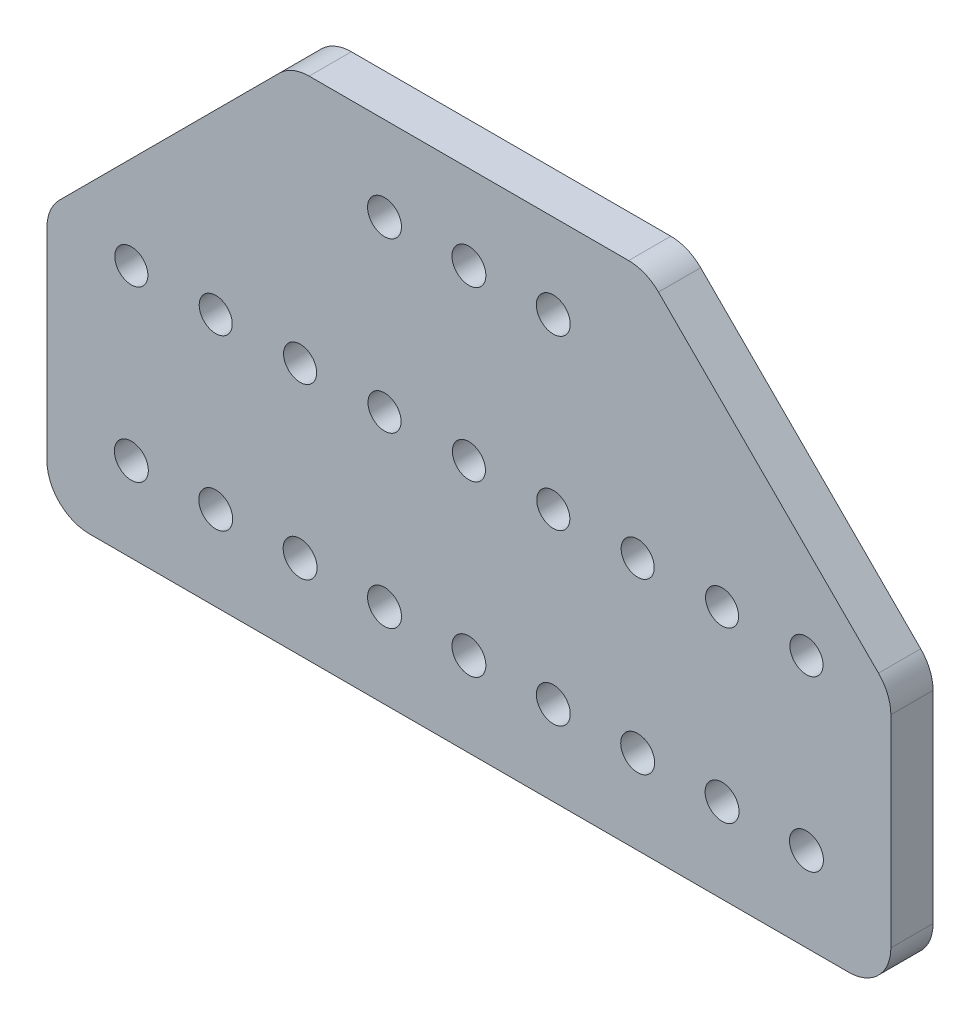
ISO-10303-21;
HEADER;
FILE_DESCRIPTION(('STEP AP214'),'2;1');
FILE_NAME('part.step','',(''),(''),'','','');
FILE_SCHEMA(('AUTOMOTIVE_DESIGN { 1 0 10303 214 1 1 1 1 }'));
ENDSEC;
DATA;
#1=APPLICATION_CONTEXT('core data for automotive mechanical design processes');
#2=APPLICATION_PROTOCOL_DEFINITION('international standard','automotive_design',2000,#1);
#3=PRODUCT_CONTEXT('',#1,'mechanical');
#4=PRODUCT('Part','Part','',(#3));
#5=PRODUCT_RELATED_PRODUCT_CATEGORY('part','',(#4));
#6=PRODUCT_DEFINITION_FORMATION('','',#4);
#7=PRODUCT_DEFINITION_CONTEXT('part definition',#1,'design');
#8=PRODUCT_DEFINITION('design','',#6,#7);
#9=PRODUCT_DEFINITION_SHAPE('','',#8);
#10=(LENGTH_UNIT() NAMED_UNIT(*) SI_UNIT(.MILLI.,.METRE.));
#11=(NAMED_UNIT(*) PLANE_ANGLE_UNIT() SI_UNIT($,.RADIAN.));
#12=(NAMED_UNIT(*) SI_UNIT($,.STERADIAN.) SOLID_ANGLE_UNIT());
#13=UNCERTAINTY_MEASURE_WITH_UNIT(LENGTH_MEASURE(1.E-05),#10,'distance_accuracy_value','');
#14=(GEOMETRIC_REPRESENTATION_CONTEXT(3) GLOBAL_UNCERTAINTY_ASSIGNED_CONTEXT((#13)) GLOBAL_UNIT_ASSIGNED_CONTEXT((#10,
#11,#12)) REPRESENTATION_CONTEXT('',''));
#15=CARTESIAN_POINT('',(0.,0.,0.));
#16=DIRECTION('',(0.,0.,1.));
#17=DIRECTION('',(1.,0.,0.));
#18=AXIS2_PLACEMENT_3D('',#15,#16,#17);
#19=CARTESIAN_POINT('',(0.,0.,6.35));
#20=DIRECTION('',(1.,0.,0.));
#21=DIRECTION('',(0.,0.,-1.));
#22=AXIS2_PLACEMENT_3D('',#19,#20,#21);
#23=PLANE('',#22);
#24=DIRECTION('',(0.,-1.,0.));
#25=VECTOR('',#24,1.);
#26=CARTESIAN_POINT('',(0.,0.,0.));
#27=LINE('',#26,#25);
#28=CARTESIAN_POINT('',(0.,36.7397438789313,0.));
#29=VERTEX_POINT('',#28);
#30=CARTESIAN_POINT('',(0.,6.35,0.));
#31=VERTEX_POINT('',#30);
#32=EDGE_CURVE('E290',#29,#31,#27,.T.);
#33=ORIENTED_EDGE('',*,*,#32,.T.);
#34=DIRECTION('',(0.,0.,-1.));
#35=VECTOR('',#34,1.);
#36=CARTESIAN_POINT('',(0.,6.35,6.35));
#37=LINE('',#36,#35);
#38=CARTESIAN_POINT('',(0.,6.35,6.35));
#39=VERTEX_POINT('',#38);
#40=EDGE_CURVE('E333',#31,#39,#37,.F.);
#41=ORIENTED_EDGE('',*,*,#40,.T.);
#42=DIRECTION('',(0.,-1.,0.));
#43=VECTOR('',#42,1.);
#44=CARTESIAN_POINT('',(0.,0.,6.35));
#45=LINE('',#44,#43);
#46=CARTESIAN_POINT('',(0.,36.7397438789313,6.35));
#47=VERTEX_POINT('',#46);
#48=EDGE_CURVE('E282',#47,#39,#45,.T.);
#49=ORIENTED_EDGE('',*,*,#48,.F.);
#50=DIRECTION('',(0.,0.,-1.));
#51=VECTOR('',#50,1.);
#52=CARTESIAN_POINT('',(0.,36.7397438789313,6.35));
#53=LINE('',#52,#51);
#54=EDGE_CURVE('E330',#47,#29,#53,.T.);
#55=ORIENTED_EDGE('',*,*,#54,.T.);
#56=EDGE_LOOP('',(#33,#41,#49,#55));
#57=FACE_BOUND('',#56,.T.);
#58=ADVANCED_FACE('F35',(#57),#23,.F.);
#59=CARTESIAN_POINT('',(0.,0.,6.35));
#60=DIRECTION('',(0.,1.,0.));
#61=DIRECTION('',(0.,0.,1.));
#62=AXIS2_PLACEMENT_3D('',#59,#60,#61);
#63=PLANE('',#62);
#64=DIRECTION('',(1.,0.,0.));
#65=VECTOR('',#64,1.);
#66=CARTESIAN_POINT('',(0.,0.,0.));
#67=LINE('',#66,#65);
#68=CARTESIAN_POINT('',(6.35,0.,0.));
#69=VERTEX_POINT('',#68);
#70=CARTESIAN_POINT('',(120.65,0.,0.));
#71=VERTEX_POINT('',#70);
#72=EDGE_CURVE('E293',#69,#71,#67,.T.);
#73=ORIENTED_EDGE('',*,*,#72,.T.);
#74=DIRECTION('',(0.,0.,-1.));
#75=VECTOR('',#74,1.);
#76=CARTESIAN_POINT('',(120.65,0.,6.35));
#77=LINE('',#76,#75);
#78=CARTESIAN_POINT('',(120.65,0.,6.35));
#79=VERTEX_POINT('',#78);
#80=EDGE_CURVE('E50',#71,#79,#77,.F.);
#81=ORIENTED_EDGE('',*,*,#80,.T.);
#82=DIRECTION('',(1.,0.,0.));
#83=VECTOR('',#82,1.);
#84=CARTESIAN_POINT('',(0.,0.,6.35));
#85=LINE('',#84,#83);
#86=CARTESIAN_POINT('',(6.35,0.,6.35));
#87=VERTEX_POINT('',#86);
#88=EDGE_CURVE('E284',#87,#79,#85,.T.);
#89=ORIENTED_EDGE('',*,*,#88,.F.);
#90=DIRECTION('',(0.,0.,-1.));
#91=VECTOR('',#90,1.);
#92=CARTESIAN_POINT('',(6.35,0.,6.35));
#93=LINE('',#92,#91);
#94=EDGE_CURVE('E326',#87,#69,#93,.T.);
#95=ORIENTED_EDGE('',*,*,#94,.T.);
#96=EDGE_LOOP('',(#73,#81,#89,#95));
#97=FACE_BOUND('',#96,.T.);
#98=ADVANCED_FACE('F372',(#97),#63,.F.);
#99=CARTESIAN_POINT('',(127.,0.,6.35));
#100=DIRECTION('',(-1.,0.,0.));
#101=DIRECTION('',(0.,0.,1.));
#102=AXIS2_PLACEMENT_3D('',#99,#100,#101);
#103=PLANE('',#102);
#104=DIRECTION('',(0.,1.,0.));
#105=VECTOR('',#104,1.);
#106=CARTESIAN_POINT('',(127.,0.,0.));
#107=LINE('',#106,#105);
#108=CARTESIAN_POINT('',(127.,6.35,0.));
#109=VERTEX_POINT('',#108);
#110=CARTESIAN_POINT('',(127.,36.7397438789313,0.));
#111=VERTEX_POINT('',#110);
#112=EDGE_CURVE('E285',#109,#111,#107,.T.);
#113=ORIENTED_EDGE('',*,*,#112,.T.);
#114=DIRECTION('',(0.,0.,-1.));
#115=VECTOR('',#114,1.);
#116=CARTESIAN_POINT('',(127.,36.7397438789313,6.35));
#117=LINE('',#116,#115);
#118=CARTESIAN_POINT('',(127.,36.7397438789313,6.35));
#119=VERTEX_POINT('',#118);
#120=EDGE_CURVE('E130',#111,#119,#117,.F.);
#121=ORIENTED_EDGE('',*,*,#120,.T.);
#122=DIRECTION('',(0.,1.,0.));
#123=VECTOR('',#122,1.);
#124=CARTESIAN_POINT('',(127.,0.,6.35));
#125=LINE('',#124,#123);
#126=CARTESIAN_POINT('',(127.,6.35,6.35));
#127=VERTEX_POINT('',#126);
#128=EDGE_CURVE('E287',#127,#119,#125,.T.);
#129=ORIENTED_EDGE('',*,*,#128,.F.);
#130=DIRECTION('',(0.,0.,-1.));
#131=VECTOR('',#130,1.);
#132=CARTESIAN_POINT('',(127.,6.35,6.35));
#133=LINE('',#132,#131);
#134=EDGE_CURVE('E135',#127,#109,#133,.T.);
#135=ORIENTED_EDGE('',*,*,#134,.T.);
#136=EDGE_LOOP('',(#113,#121,#129,#135));
#137=FACE_BOUND('',#136,.T.);
#138=ADVANCED_FACE('F379',(#137),#103,.F.);
#139=CARTESIAN_POINT('',(0.,0.,6.35));
#140=DIRECTION('',(0.,0.,-1.));
#141=DIRECTION('',(-1.,0.,0.));
#142=AXIS2_PLACEMENT_3D('',#139,#140,#141);
#143=PLANE('',#142);
#144=CARTESIAN_POINT('',(38.1,38.1000000000009,6.35));
#145=DIRECTION('',(0.,0.,-1.));
#146=DIRECTION('',(-1.,0.,0.));
#147=AXIS2_PLACEMENT_3D('',#144,#145,#146);
#148=CIRCLE('',#147,2.4892);
#149=CARTESIAN_POINT('',(35.6108,38.1000000000009,6.35));
#150=VERTEX_POINT('',#149);
#151=EDGE_CURVE('E202',#150,#150,#148,.T.);
#152=ORIENTED_EDGE('',*,*,#151,.T.);
#153=EDGE_LOOP('',(#152));
#154=FACE_BOUND('',#153,.T.);
#155=CARTESIAN_POINT('',(50.8,12.7000000000009,6.35));
#156=DIRECTION('',(0.,0.,-1.));
#157=DIRECTION('',(-1.,0.,0.));
#158=AXIS2_PLACEMENT_3D('',#155,#156,#157);
#159=CIRCLE('',#158,2.55270000000001);
#160=CARTESIAN_POINT('',(48.2473,12.7000000000009,6.35));
#161=VERTEX_POINT('',#160);
#162=EDGE_CURVE('E195',#161,#161,#159,.T.);
#163=ORIENTED_EDGE('',*,*,#162,.T.);
#164=EDGE_LOOP('',(#163));
#165=FACE_BOUND('',#164,.T.);
#166=CARTESIAN_POINT('',(50.8,38.1000000000009,6.35));
#167=DIRECTION('',(0.,0.,-1.));
#168=DIRECTION('',(-1.,0.,0.));
#169=AXIS2_PLACEMENT_3D('',#166,#167,#168);
#170=CIRCLE('',#169,2.4892);
#171=CARTESIAN_POINT('',(48.3108,38.1000000000009,6.35));
#172=VERTEX_POINT('',#171);
#173=EDGE_CURVE('E214',#172,#172,#170,.T.);
#174=ORIENTED_EDGE('',*,*,#173,.T.);
#175=EDGE_LOOP('',(#174));
#176=FACE_BOUND('',#175,.T.);
#177=CARTESIAN_POINT('',(63.5,12.7000000000009,6.35));
#178=DIRECTION('',(0.,0.,-1.));
#179=DIRECTION('',(-1.,0.,0.));
#180=AXIS2_PLACEMENT_3D('',#177,#178,#179);
#181=CIRCLE('',#180,2.55270000000001);
#182=CARTESIAN_POINT('',(60.9473,12.7000000000009,6.35));
#183=VERTEX_POINT('',#182);
#184=EDGE_CURVE('E207',#183,#183,#181,.T.);
#185=ORIENTED_EDGE('',*,*,#184,.T.);
#186=EDGE_LOOP('',(#185));
#187=FACE_BOUND('',#186,.T.);
#188=CARTESIAN_POINT('',(12.7,38.1000000000009,6.35));
#189=DIRECTION('',(0.,0.,-1.));
#190=DIRECTION('',(-1.,0.,0.));
#191=AXIS2_PLACEMENT_3D('',#188,#189,#190);
#192=CIRCLE('',#191,2.4892);
#193=CARTESIAN_POINT('',(10.2108,38.1000000000009,6.35));
#194=VERTEX_POINT('',#193);
#195=EDGE_CURVE('E178',#194,#194,#192,.T.);
#196=ORIENTED_EDGE('',*,*,#195,.T.);
#197=EDGE_LOOP('',(#196));
#198=FACE_BOUND('',#197,.T.);
#199=CARTESIAN_POINT('',(25.4,12.7000000000009,6.35));
#200=DIRECTION('',(0.,0.,-1.));
#201=DIRECTION('',(-1.,0.,0.));
#202=AXIS2_PLACEMENT_3D('',#199,#200,#201);
#203=CIRCLE('',#202,2.55270000000001);
#204=CARTESIAN_POINT('',(22.8473,12.7000000000009,6.35));
#205=VERTEX_POINT('',#204);
#206=EDGE_CURVE('E171',#205,#205,#203,.T.);
#207=ORIENTED_EDGE('',*,*,#206,.T.);
#208=EDGE_LOOP('',(#207));
#209=FACE_BOUND('',#208,.T.);
#210=CARTESIAN_POINT('',(25.4,38.1000000000009,6.35));
#211=DIRECTION('',(0.,0.,-1.));
#212=DIRECTION('',(-1.,0.,0.));
#213=AXIS2_PLACEMENT_3D('',#210,#211,#212);
#214=CIRCLE('',#213,2.4892);
#215=CARTESIAN_POINT('',(22.9108,38.1000000000009,6.35));
#216=VERTEX_POINT('',#215);
#217=EDGE_CURVE('E190',#216,#216,#214,.T.);
#218=ORIENTED_EDGE('',*,*,#217,.T.);
#219=EDGE_LOOP('',(#218));
#220=FACE_BOUND('',#219,.T.);
#221=CARTESIAN_POINT('',(38.1,12.7000000000009,6.35));
#222=DIRECTION('',(0.,0.,-1.));
#223=DIRECTION('',(-1.,0.,0.));
#224=AXIS2_PLACEMENT_3D('',#221,#222,#223);
#225=CIRCLE('',#224,2.55270000000001);
#226=CARTESIAN_POINT('',(35.5473,12.7000000000009,6.35));
#227=VERTEX_POINT('',#226);
#228=EDGE_CURVE('E183',#227,#227,#225,.T.);
#229=ORIENTED_EDGE('',*,*,#228,.T.);
#230=EDGE_LOOP('',(#229));
#231=FACE_BOUND('',#230,.T.);
#232=CARTESIAN_POINT('',(88.9,38.1000000000009,6.35));
#233=DIRECTION('',(0.,0.,-1.));
#234=DIRECTION('',(-1.,0.,0.));
#235=AXIS2_PLACEMENT_3D('',#232,#233,#234);
#236=CIRCLE('',#235,2.4892);
#237=CARTESIAN_POINT('',(86.4108,38.1000000000009,6.35));
#238=VERTEX_POINT('',#237);
#239=EDGE_CURVE('E250',#238,#238,#236,.T.);
#240=ORIENTED_EDGE('',*,*,#239,.T.);
#241=EDGE_LOOP('',(#240));
#242=FACE_BOUND('',#241,.T.);
#243=CARTESIAN_POINT('',(101.6,12.7000000000009,6.35));
#244=DIRECTION('',(0.,0.,-1.));
#245=DIRECTION('',(-1.,0.,0.));
#246=AXIS2_PLACEMENT_3D('',#243,#244,#245);
#247=CIRCLE('',#246,2.55270000000001);
#248=CARTESIAN_POINT('',(99.0473,12.7000000000009,6.35));
#249=VERTEX_POINT('',#248);
#250=EDGE_CURVE('E243',#249,#249,#247,.T.);
#251=ORIENTED_EDGE('',*,*,#250,.T.);
#252=EDGE_LOOP('',(#251));
#253=FACE_BOUND('',#252,.T.);
#254=CARTESIAN_POINT('',(101.6,38.1000000000009,6.35));
#255=DIRECTION('',(0.,0.,-1.));
#256=DIRECTION('',(-1.,0.,0.));
#257=AXIS2_PLACEMENT_3D('',#254,#255,#256);
#258=CIRCLE('',#257,2.4892);
#259=CARTESIAN_POINT('',(99.1108,38.1000000000009,6.35));
#260=VERTEX_POINT('',#259);
#261=EDGE_CURVE('E262',#260,#260,#258,.T.);
#262=ORIENTED_EDGE('',*,*,#261,.T.);
#263=EDGE_LOOP('',(#262));
#264=FACE_BOUND('',#263,.T.);
#265=CARTESIAN_POINT('',(114.3,12.7000000000009,6.35));
#266=DIRECTION('',(0.,0.,-1.));
#267=DIRECTION('',(-1.,0.,0.));
#268=AXIS2_PLACEMENT_3D('',#265,#266,#267);
#269=CIRCLE('',#268,2.55270000000001);
#270=CARTESIAN_POINT('',(111.7473,12.7000000000009,6.35));
#271=VERTEX_POINT('',#270);
#272=EDGE_CURVE('E255',#271,#271,#269,.T.);
#273=ORIENTED_EDGE('',*,*,#272,.T.);
#274=EDGE_LOOP('',(#273));
#275=FACE_BOUND('',#274,.T.);
#276=CARTESIAN_POINT('',(63.5,38.1000000000009,6.35));
#277=DIRECTION('',(0.,0.,-1.));
#278=DIRECTION('',(-1.,0.,0.));
#279=AXIS2_PLACEMENT_3D('',#276,#277,#278);
#280=CIRCLE('',#279,2.4892);
#281=CARTESIAN_POINT('',(61.0108,38.1000000000009,6.35));
#282=VERTEX_POINT('',#281);
#283=EDGE_CURVE('E226',#282,#282,#280,.T.);
#284=ORIENTED_EDGE('',*,*,#283,.T.);
#285=EDGE_LOOP('',(#284));
#286=FACE_BOUND('',#285,.T.);
#287=CARTESIAN_POINT('',(76.2,12.7000000000009,6.35));
#288=DIRECTION('',(0.,0.,-1.));
#289=DIRECTION('',(-1.,0.,0.));
#290=AXIS2_PLACEMENT_3D('',#287,#288,#289);
#291=CIRCLE('',#290,2.55270000000001);
#292=CARTESIAN_POINT('',(73.6473,12.7000000000009,6.35));
#293=VERTEX_POINT('',#292);
#294=EDGE_CURVE('E219',#293,#293,#291,.T.);
#295=ORIENTED_EDGE('',*,*,#294,.T.);
#296=EDGE_LOOP('',(#295));
#297=FACE_BOUND('',#296,.T.);
#298=CARTESIAN_POINT('',(76.2,38.1000000000009,6.35));
#299=DIRECTION('',(0.,0.,-1.));
#300=DIRECTION('',(-1.,0.,0.));
#301=AXIS2_PLACEMENT_3D('',#298,#299,#300);
#302=CIRCLE('',#301,2.4892);
#303=CARTESIAN_POINT('',(73.7108,38.1000000000009,6.35));
#304=VERTEX_POINT('',#303);
#305=EDGE_CURVE('E238',#304,#304,#302,.T.);
#306=ORIENTED_EDGE('',*,*,#305,.T.);
#307=EDGE_LOOP('',(#306));
#308=FACE_BOUND('',#307,.T.);
#309=CARTESIAN_POINT('',(88.9,12.7000000000009,6.35));
#310=DIRECTION('',(0.,0.,-1.));
#311=DIRECTION('',(-1.,0.,0.));
#312=AXIS2_PLACEMENT_3D('',#309,#310,#311);
#313=CIRCLE('',#312,2.55270000000001);
#314=CARTESIAN_POINT('',(86.3473,12.7000000000009,6.35));
#315=VERTEX_POINT('',#314);
#316=EDGE_CURVE('E231',#315,#315,#313,.T.);
#317=ORIENTED_EDGE('',*,*,#316,.T.);
#318=EDGE_LOOP('',(#317));
#319=FACE_BOUND('',#318,.T.);
#320=CARTESIAN_POINT('',(12.7,12.7000000000009,6.35));
#321=DIRECTION('',(0.,0.,-1.));
#322=DIRECTION('',(-1.,0.,0.));
#323=AXIS2_PLACEMENT_3D('',#320,#321,#322);
#324=CIRCLE('',#323,2.55270000000001);
#325=CARTESIAN_POINT('',(10.1473,12.7000000000009,6.35));
#326=VERTEX_POINT('',#325);
#327=EDGE_CURVE('E165',#326,#326,#324,.T.);
#328=ORIENTED_EDGE('',*,*,#327,.T.);
#329=EDGE_LOOP('',(#328));
#330=FACE_BOUND('',#329,.T.);
#331=CARTESIAN_POINT('',(114.3,38.1000000000009,6.35));
#332=DIRECTION('',(0.,0.,-1.));
#333=DIRECTION('',(-1.,0.,0.));
#334=AXIS2_PLACEMENT_3D('',#331,#332,#333);
#335=CIRCLE('',#334,2.4892);
#336=CARTESIAN_POINT('',(111.8108,38.1000000000009,6.35));
#337=VERTEX_POINT('',#336);
#338=EDGE_CURVE('E267',#337,#337,#335,.T.);
#339=ORIENTED_EDGE('',*,*,#338,.T.);
#340=EDGE_LOOP('',(#339));
#341=FACE_BOUND('',#340,.T.);
#342=CARTESIAN_POINT('',(76.2,63.5,6.35));
#343=DIRECTION('',(0.,0.,-1.));
#344=DIRECTION('',(-1.,0.,0.));
#345=AXIS2_PLACEMENT_3D('',#342,#343,#344);
#346=CIRCLE('',#345,2.55270000000003);
#347=CARTESIAN_POINT('',(73.6473,63.5,6.35));
#348=VERTEX_POINT('',#347);
#349=EDGE_CURVE('E273',#348,#348,#346,.T.);
#350=ORIENTED_EDGE('',*,*,#349,.T.);
#351=EDGE_LOOP('',(#350));
#352=FACE_BOUND('',#351,.T.);
#353=CARTESIAN_POINT('',(63.5,63.5,6.35));
#354=DIRECTION('',(0.,0.,-1.));
#355=DIRECTION('',(-1.,0.,0.));
#356=AXIS2_PLACEMENT_3D('',#353,#354,#355);
#357=CIRCLE('',#356,2.55270000000003);
#358=CARTESIAN_POINT('',(60.9473,63.5,6.35));
#359=VERTEX_POINT('',#358);
#360=EDGE_CURVE('E277',#359,#359,#357,.T.);
#361=ORIENTED_EDGE('',*,*,#360,.T.);
#362=EDGE_LOOP('',(#361));
#363=FACE_BOUND('',#362,.T.);
#364=CARTESIAN_POINT('',(50.8,63.5,6.35));
#365=DIRECTION('',(0.,0.,-1.));
#366=DIRECTION('',(-1.,0.,0.));
#367=AXIS2_PLACEMENT_3D('',#364,#365,#366);
#368=CIRCLE('',#367,2.55270000000001);
#369=CARTESIAN_POINT('',(48.2473,63.5,6.35));
#370=VERTEX_POINT('',#369);
#371=EDGE_CURVE('E270',#370,#370,#368,.T.);
#372=ORIENTED_EDGE('',*,*,#371,.T.);
#373=EDGE_LOOP('',(#372));
#374=FACE_BOUND('',#373,.T.);
#375=ORIENTED_EDGE('',*,*,#128,.T.);
#376=CARTESIAN_POINT('',(120.65,36.7397438789313,6.35));
#377=DIRECTION('',(0.,0.,-1.));
#378=DIRECTION('',(-1.,0.,0.));
#379=AXIS2_PLACEMENT_3D('',#376,#377,#378);
#380=CIRCLE('',#379,6.35);
#381=CARTESIAN_POINT('',(125.140128060535,41.2298719394659,6.35));
#382=VERTEX_POINT('',#381);
#383=EDGE_CURVE('E324',#119,#382,#380,.F.);
#384=ORIENTED_EDGE('',*,*,#383,.T.);
#385=DIRECTION('',(-0.707106781186551,0.707106781186544,0.));
#386=VECTOR('',#385,1.);
#387=CARTESIAN_POINT('',(83.82,82.55,6.35));
#388=LINE('',#387,#386);
#389=CARTESIAN_POINT('',(92.0298719394655,74.3401280605346,6.35));
#390=VERTEX_POINT('',#389);
#391=EDGE_CURVE('E145',#382,#390,#388,.T.);
#392=ORIENTED_EDGE('',*,*,#391,.T.);
#393=CARTESIAN_POINT('',(87.5397438789309,69.85,6.35));
#394=DIRECTION('',(0.,0.,-1.));
#395=DIRECTION('',(-1.,0.,0.));
#396=AXIS2_PLACEMENT_3D('',#393,#394,#395);
#397=CIRCLE('',#396,6.35);
#398=CARTESIAN_POINT('',(87.5397438789309,76.2,6.35));
#399=VERTEX_POINT('',#398);
#400=EDGE_CURVE('E317',#390,#399,#397,.F.);
#401=ORIENTED_EDGE('',*,*,#400,.T.);
#402=DIRECTION('',(-1.,0.,0.));
#403=VECTOR('',#402,1.);
#404=CARTESIAN_POINT('',(90.1700000000004,76.2,6.35));
#405=LINE('',#404,#403);
#406=CARTESIAN_POINT('',(39.4602561210691,76.2,6.35));
#407=VERTEX_POINT('',#406);
#408=EDGE_CURVE('E164',#399,#407,#405,.T.);
#409=ORIENTED_EDGE('',*,*,#408,.T.);
#410=CARTESIAN_POINT('',(39.4602561210691,69.85,6.35));
#411=DIRECTION('',(0.,0.,-1.));
#412=DIRECTION('',(-1.,0.,0.));
#413=AXIS2_PLACEMENT_3D('',#410,#411,#412);
#414=CIRCLE('',#413,6.35);
#415=CARTESIAN_POINT('',(34.9701280605345,74.3401280605346,6.35));
#416=VERTEX_POINT('',#415);
#417=EDGE_CURVE('E319',#407,#416,#414,.F.);
#418=ORIENTED_EDGE('',*,*,#417,.T.);
#419=DIRECTION('',(-0.707106781186551,-0.707106781186544,0.));
#420=VECTOR('',#419,1.);
#421=CARTESIAN_POINT('',(0.,39.3700000000005,6.35));
#422=LINE('',#421,#420);
#423=CARTESIAN_POINT('',(1.85987193946545,41.2298719394659,6.35));
#424=VERTEX_POINT('',#423);
#425=EDGE_CURVE('E153',#416,#424,#422,.T.);
#426=ORIENTED_EDGE('',*,*,#425,.T.);
#427=CARTESIAN_POINT('',(6.35,36.7397438789313,6.35));
#428=DIRECTION('',(0.,0.,-1.));
#429=DIRECTION('',(-1.,0.,0.));
#430=AXIS2_PLACEMENT_3D('',#427,#428,#429);
#431=CIRCLE('',#430,6.35);
#432=EDGE_CURVE('E315',#424,#47,#431,.F.);
#433=ORIENTED_EDGE('',*,*,#432,.T.);
#434=ORIENTED_EDGE('',*,*,#48,.T.);
#435=CARTESIAN_POINT('',(6.35,6.35,6.35));
#436=DIRECTION('',(0.,0.,-1.));
#437=DIRECTION('',(-1.,0.,0.));
#438=AXIS2_PLACEMENT_3D('',#435,#436,#437);
#439=CIRCLE('',#438,6.35);
#440=EDGE_CURVE('E57',#39,#87,#439,.F.);
#441=ORIENTED_EDGE('',*,*,#440,.T.);
#442=ORIENTED_EDGE('',*,*,#88,.T.);
#443=CARTESIAN_POINT('',(120.65,6.35,6.35));
#444=DIRECTION('',(0.,0.,-1.));
#445=DIRECTION('',(-1.,0.,0.));
#446=AXIS2_PLACEMENT_3D('',#443,#444,#445);
#447=CIRCLE('',#446,6.35);
#448=EDGE_CURVE('E322',#79,#127,#447,.F.);
#449=ORIENTED_EDGE('',*,*,#448,.T.);
#450=EDGE_LOOP('',(#375,#384,#392,#401,#409,#418,#426,#433,#434,#441,#442,#449));
#451=FACE_BOUND('',#450,.T.);
#452=ADVANCED_FACE('F353',(#154,#165,#176,#187,#198,#209,#220,#231,#242,#253,#264,#275,#286,
#297,#308,#319,#330,#341,#352,#363,#374,#451),#143,.F.);
#453=CARTESIAN_POINT('',(0.,0.,0.));
#454=DIRECTION('',(0.,0.,-1.));
#455=DIRECTION('',(-1.,0.,0.));
#456=AXIS2_PLACEMENT_3D('',#453,#454,#455);
#457=PLANE('',#456);
#458=DIRECTION('',(-0.707106781186551,0.707106781186544,0.));
#459=VECTOR('',#458,1.);
#460=CARTESIAN_POINT('',(83.82,82.55,0.));
#461=LINE('',#460,#459);
#462=CARTESIAN_POINT('',(125.140128060535,41.2298719394659,0.));
#463=VERTEX_POINT('',#462);
#464=CARTESIAN_POINT('',(92.0298719394655,74.3401280605346,0.));
#465=VERTEX_POINT('',#464);
#466=EDGE_CURVE('E142',#463,#465,#461,.T.);
#467=ORIENTED_EDGE('',*,*,#466,.F.);
#468=CARTESIAN_POINT('',(120.65,36.7397438789313,0.));
#469=DIRECTION('',(0.,0.,-1.));
#470=DIRECTION('',(-1.,0.,0.));
#471=AXIS2_PLACEMENT_3D('',#468,#469,#470);
#472=CIRCLE('',#471,6.35);
#473=EDGE_CURVE('E125',#463,#111,#472,.T.);
#474=ORIENTED_EDGE('',*,*,#473,.T.);
#475=ORIENTED_EDGE('',*,*,#112,.F.);
#476=CARTESIAN_POINT('',(120.65,6.35,0.));
#477=DIRECTION('',(0.,0.,-1.));
#478=DIRECTION('',(-1.,0.,0.));
#479=AXIS2_PLACEMENT_3D('',#476,#477,#478);
#480=CIRCLE('',#479,6.35);
#481=EDGE_CURVE('E136',#109,#71,#480,.T.);
#482=ORIENTED_EDGE('',*,*,#481,.T.);
#483=ORIENTED_EDGE('',*,*,#72,.F.);
#484=CARTESIAN_POINT('',(6.35,6.35,0.));
#485=DIRECTION('',(0.,0.,-1.));
#486=DIRECTION('',(-1.,0.,0.));
#487=AXIS2_PLACEMENT_3D('',#484,#485,#486);
#488=CIRCLE('',#487,6.35);
#489=EDGE_CURVE('E309',#69,#31,#488,.T.);
#490=ORIENTED_EDGE('',*,*,#489,.T.);
#491=ORIENTED_EDGE('',*,*,#32,.F.);
#492=CARTESIAN_POINT('',(6.35,36.7397438789313,0.));
#493=DIRECTION('',(0.,0.,-1.));
#494=DIRECTION('',(-1.,0.,0.));
#495=AXIS2_PLACEMENT_3D('',#492,#493,#494);
#496=CIRCLE('',#495,6.35);
#497=CARTESIAN_POINT('',(1.85987193946545,41.2298719394659,0.));
#498=VERTEX_POINT('',#497);
#499=EDGE_CURVE('E146',#29,#498,#496,.T.);
#500=ORIENTED_EDGE('',*,*,#499,.T.);
#501=DIRECTION('',(-0.707106781186551,-0.707106781186544,0.));
#502=VECTOR('',#501,1.);
#503=CARTESIAN_POINT('',(0.,39.3700000000005,0.));
#504=LINE('',#503,#502);
#505=CARTESIAN_POINT('',(34.9701280605345,74.3401280605346,0.));
#506=VERTEX_POINT('',#505);
#507=EDGE_CURVE('E158',#506,#498,#504,.T.);
#508=ORIENTED_EDGE('',*,*,#507,.F.);
#509=CARTESIAN_POINT('',(39.4602561210691,69.85,0.));
#510=DIRECTION('',(0.,0.,-1.));
#511=DIRECTION('',(-1.,0.,0.));
#512=AXIS2_PLACEMENT_3D('',#509,#510,#511);
#513=CIRCLE('',#512,6.35);
#514=CARTESIAN_POINT('',(39.4602561210691,76.2,0.));
#515=VERTEX_POINT('',#514);
#516=EDGE_CURVE('E307',#506,#515,#513,.T.);
#517=ORIENTED_EDGE('',*,*,#516,.T.);
#518=DIRECTION('',(-1.,0.,0.));
#519=VECTOR('',#518,1.);
#520=CARTESIAN_POINT('',(90.1700000000004,76.2,0.));
#521=LINE('',#520,#519);
#522=CARTESIAN_POINT('',(87.5397438789309,76.2,0.));
#523=VERTEX_POINT('',#522);
#524=EDGE_CURVE('E345',#523,#515,#521,.T.);
#525=ORIENTED_EDGE('',*,*,#524,.F.);
#526=CARTESIAN_POINT('',(87.5397438789309,69.85,0.));
#527=DIRECTION('',(0.,0.,-1.));
#528=DIRECTION('',(-1.,0.,0.));
#529=AXIS2_PLACEMENT_3D('',#526,#527,#528);
#530=CIRCLE('',#529,6.35);
#531=EDGE_CURVE('E152',#523,#465,#530,.T.);
#532=ORIENTED_EDGE('',*,*,#531,.T.);
#533=EDGE_LOOP('',(#467,#474,#475,#482,#483,#490,#491,#500,#508,#517,#525,#532));
#534=FACE_BOUND('',#533,.T.);
#535=CARTESIAN_POINT('',(38.1,38.1000000000009,0.));
#536=DIRECTION('',(0.,0.,-1.));
#537=DIRECTION('',(-1.,0.,0.));
#538=AXIS2_PLACEMENT_3D('',#535,#536,#537);
#539=CIRCLE('',#538,2.4892);
#540=CARTESIAN_POINT('',(35.6108,38.1000000000009,0.));
#541=VERTEX_POINT('',#540);
#542=EDGE_CURVE('E186',#541,#541,#539,.T.);
#543=ORIENTED_EDGE('',*,*,#542,.F.);
#544=EDGE_LOOP('',(#543));
#545=FACE_BOUND('',#544,.T.);
#546=CARTESIAN_POINT('',(50.8,12.7000000000009,0.));
#547=DIRECTION('',(0.,0.,-1.));
#548=DIRECTION('',(-1.,0.,0.));
#549=AXIS2_PLACEMENT_3D('',#546,#547,#548);
#550=CIRCLE('',#549,2.55270000000001);
#551=CARTESIAN_POINT('',(48.2473,12.7000000000009,0.));
#552=VERTEX_POINT('',#551);
#553=EDGE_CURVE('E199',#552,#552,#550,.T.);
#554=ORIENTED_EDGE('',*,*,#553,.F.);
#555=EDGE_LOOP('',(#554));
#556=FACE_BOUND('',#555,.T.);
#557=CARTESIAN_POINT('',(50.8,38.1000000000009,0.));
#558=DIRECTION('',(0.,0.,-1.));
#559=DIRECTION('',(-1.,0.,0.));
#560=AXIS2_PLACEMENT_3D('',#557,#558,#559);
#561=CIRCLE('',#560,2.4892);
#562=CARTESIAN_POINT('',(48.3108,38.1000000000009,0.));
#563=VERTEX_POINT('',#562);
#564=EDGE_CURVE('E198',#563,#563,#561,.T.);
#565=ORIENTED_EDGE('',*,*,#564,.F.);
#566=EDGE_LOOP('',(#565));
#567=FACE_BOUND('',#566,.T.);
#568=CARTESIAN_POINT('',(63.5,12.7000000000009,0.));
#569=DIRECTION('',(0.,0.,-1.));
#570=DIRECTION('',(-1.,0.,0.));
#571=AXIS2_PLACEMENT_3D('',#568,#569,#570);
#572=CIRCLE('',#571,2.55270000000001);
#573=CARTESIAN_POINT('',(60.9473,12.7000000000009,0.));
#574=VERTEX_POINT('',#573);
#575=EDGE_CURVE('E211',#574,#574,#572,.T.);
#576=ORIENTED_EDGE('',*,*,#575,.F.);
#577=EDGE_LOOP('',(#576));
#578=FACE_BOUND('',#577,.T.);
#579=CARTESIAN_POINT('',(12.7,38.1000000000009,0.));
#580=DIRECTION('',(0.,0.,-1.));
#581=DIRECTION('',(-1.,0.,0.));
#582=AXIS2_PLACEMENT_3D('',#579,#580,#581);
#583=CIRCLE('',#582,2.4892);
#584=CARTESIAN_POINT('',(10.2108,38.1000000000009,0.));
#585=VERTEX_POINT('',#584);
#586=EDGE_CURVE('E168',#585,#585,#583,.T.);
#587=ORIENTED_EDGE('',*,*,#586,.F.);
#588=EDGE_LOOP('',(#587));
#589=FACE_BOUND('',#588,.T.);
#590=CARTESIAN_POINT('',(25.4,12.7000000000009,0.));
#591=DIRECTION('',(0.,0.,-1.));
#592=DIRECTION('',(-1.,0.,0.));
#593=AXIS2_PLACEMENT_3D('',#590,#591,#592);
#594=CIRCLE('',#593,2.55270000000001);
#595=CARTESIAN_POINT('',(22.8473,12.7000000000009,0.));
#596=VERTEX_POINT('',#595);
#597=EDGE_CURVE('E175',#596,#596,#594,.T.);
#598=ORIENTED_EDGE('',*,*,#597,.F.);
#599=EDGE_LOOP('',(#598));
#600=FACE_BOUND('',#599,.T.);
#601=CARTESIAN_POINT('',(25.4,38.1000000000009,0.));
#602=DIRECTION('',(0.,0.,-1.));
#603=DIRECTION('',(-1.,0.,0.));
#604=AXIS2_PLACEMENT_3D('',#601,#602,#603);
#605=CIRCLE('',#604,2.4892);
#606=CARTESIAN_POINT('',(22.9108,38.1000000000009,0.));
#607=VERTEX_POINT('',#606);
#608=EDGE_CURVE('E174',#607,#607,#605,.T.);
#609=ORIENTED_EDGE('',*,*,#608,.F.);
#610=EDGE_LOOP('',(#609));
#611=FACE_BOUND('',#610,.T.);
#612=CARTESIAN_POINT('',(38.1,12.7000000000009,0.));
#613=DIRECTION('',(0.,0.,-1.));
#614=DIRECTION('',(-1.,0.,0.));
#615=AXIS2_PLACEMENT_3D('',#612,#613,#614);
#616=CIRCLE('',#615,2.55270000000001);
#617=CARTESIAN_POINT('',(35.5473,12.7000000000009,0.));
#618=VERTEX_POINT('',#617);
#619=EDGE_CURVE('E187',#618,#618,#616,.T.);
#620=ORIENTED_EDGE('',*,*,#619,.F.);
#621=EDGE_LOOP('',(#620));
#622=FACE_BOUND('',#621,.T.);
#623=CARTESIAN_POINT('',(88.9,38.1000000000009,0.));
#624=DIRECTION('',(0.,0.,-1.));
#625=DIRECTION('',(-1.,0.,0.));
#626=AXIS2_PLACEMENT_3D('',#623,#624,#625);
#627=CIRCLE('',#626,2.4892);
#628=CARTESIAN_POINT('',(86.4108,38.1000000000009,0.));
#629=VERTEX_POINT('',#628);
#630=EDGE_CURVE('E234',#629,#629,#627,.T.);
#631=ORIENTED_EDGE('',*,*,#630,.F.);
#632=EDGE_LOOP('',(#631));
#633=FACE_BOUND('',#632,.T.);
#634=CARTESIAN_POINT('',(101.6,12.7000000000009,0.));
#635=DIRECTION('',(0.,0.,-1.));
#636=DIRECTION('',(-1.,0.,0.));
#637=AXIS2_PLACEMENT_3D('',#634,#635,#636);
#638=CIRCLE('',#637,2.55270000000001);
#639=CARTESIAN_POINT('',(99.0473,12.7000000000009,0.));
#640=VERTEX_POINT('',#639);
#641=EDGE_CURVE('E247',#640,#640,#638,.T.);
#642=ORIENTED_EDGE('',*,*,#641,.F.);
#643=EDGE_LOOP('',(#642));
#644=FACE_BOUND('',#643,.T.);
#645=CARTESIAN_POINT('',(101.6,38.1000000000009,0.));
#646=DIRECTION('',(0.,0.,-1.));
#647=DIRECTION('',(-1.,0.,0.));
#648=AXIS2_PLACEMENT_3D('',#645,#646,#647);
#649=CIRCLE('',#648,2.4892);
#650=CARTESIAN_POINT('',(99.1108,38.1000000000009,0.));
#651=VERTEX_POINT('',#650);
#652=EDGE_CURVE('E246',#651,#651,#649,.T.);
#653=ORIENTED_EDGE('',*,*,#652,.F.);
#654=EDGE_LOOP('',(#653));
#655=FACE_BOUND('',#654,.T.);
#656=CARTESIAN_POINT('',(114.3,12.7000000000009,0.));
#657=DIRECTION('',(0.,0.,-1.));
#658=DIRECTION('',(-1.,0.,0.));
#659=AXIS2_PLACEMENT_3D('',#656,#657,#658);
#660=CIRCLE('',#659,2.55270000000001);
#661=CARTESIAN_POINT('',(111.7473,12.7000000000009,0.));
#662=VERTEX_POINT('',#661);
#663=EDGE_CURVE('E259',#662,#662,#660,.T.);
#664=ORIENTED_EDGE('',*,*,#663,.F.);
#665=EDGE_LOOP('',(#664));
#666=FACE_BOUND('',#665,.T.);
#667=CARTESIAN_POINT('',(63.5,38.1000000000009,0.));
#668=DIRECTION('',(0.,0.,-1.));
#669=DIRECTION('',(-1.,0.,0.));
#670=AXIS2_PLACEMENT_3D('',#667,#668,#669);
#671=CIRCLE('',#670,2.4892);
#672=CARTESIAN_POINT('',(61.0108,38.1000000000009,0.));
#673=VERTEX_POINT('',#672);
#674=EDGE_CURVE('E210',#673,#673,#671,.T.);
#675=ORIENTED_EDGE('',*,*,#674,.F.);
#676=EDGE_LOOP('',(#675));
#677=FACE_BOUND('',#676,.T.);
#678=CARTESIAN_POINT('',(76.2,12.7000000000009,0.));
#679=DIRECTION('',(0.,0.,-1.));
#680=DIRECTION('',(-1.,0.,0.));
#681=AXIS2_PLACEMENT_3D('',#678,#679,#680);
#682=CIRCLE('',#681,2.55270000000001);
#683=CARTESIAN_POINT('',(73.6473,12.7000000000009,0.));
#684=VERTEX_POINT('',#683);
#685=EDGE_CURVE('E223',#684,#684,#682,.T.);
#686=ORIENTED_EDGE('',*,*,#685,.F.);
#687=EDGE_LOOP('',(#686));
#688=FACE_BOUND('',#687,.T.);
#689=CARTESIAN_POINT('',(76.2,38.1000000000009,0.));
#690=DIRECTION('',(0.,0.,-1.));
#691=DIRECTION('',(-1.,0.,0.));
#692=AXIS2_PLACEMENT_3D('',#689,#690,#691);
#693=CIRCLE('',#692,2.4892);
#694=CARTESIAN_POINT('',(73.7108,38.1000000000009,0.));
#695=VERTEX_POINT('',#694);
#696=EDGE_CURVE('E222',#695,#695,#693,.T.);
#697=ORIENTED_EDGE('',*,*,#696,.F.);
#698=EDGE_LOOP('',(#697));
#699=FACE_BOUND('',#698,.T.);
#700=CARTESIAN_POINT('',(88.9,12.7000000000009,0.));
#701=DIRECTION('',(0.,0.,-1.));
#702=DIRECTION('',(-1.,0.,0.));
#703=AXIS2_PLACEMENT_3D('',#700,#701,#702);
#704=CIRCLE('',#703,2.55270000000001);
#705=CARTESIAN_POINT('',(86.3473,12.7000000000009,0.));
#706=VERTEX_POINT('',#705);
#707=EDGE_CURVE('E235',#706,#706,#704,.T.);
#708=ORIENTED_EDGE('',*,*,#707,.F.);
#709=EDGE_LOOP('',(#708));
#710=FACE_BOUND('',#709,.T.);
#711=CARTESIAN_POINT('',(12.7,12.7000000000009,0.));
#712=DIRECTION('',(0.,0.,-1.));
#713=DIRECTION('',(-1.,0.,0.));
#714=AXIS2_PLACEMENT_3D('',#711,#712,#713);
#715=CIRCLE('',#714,2.55270000000001);
#716=CARTESIAN_POINT('',(10.1473,12.7000000000009,0.));
#717=VERTEX_POINT('',#716);
#718=EDGE_CURVE('E155',#717,#717,#715,.T.);
#719=ORIENTED_EDGE('',*,*,#718,.F.);
#720=EDGE_LOOP('',(#719));
#721=FACE_BOUND('',#720,.T.);
#722=CARTESIAN_POINT('',(114.3,38.1000000000009,0.));
#723=DIRECTION('',(0.,0.,-1.));
#724=DIRECTION('',(-1.,0.,0.));
#725=AXIS2_PLACEMENT_3D('',#722,#723,#724);
#726=CIRCLE('',#725,2.4892);
#727=CARTESIAN_POINT('',(111.8108,38.1000000000009,0.));
#728=VERTEX_POINT('',#727);
#729=EDGE_CURVE('E258',#728,#728,#726,.T.);
#730=ORIENTED_EDGE('',*,*,#729,.F.);
#731=EDGE_LOOP('',(#730));
#732=FACE_BOUND('',#731,.T.);
#733=CARTESIAN_POINT('',(76.2,63.5,0.));
#734=DIRECTION('',(0.,0.,-1.));
#735=DIRECTION('',(-1.,0.,0.));
#736=AXIS2_PLACEMENT_3D('',#733,#734,#735);
#737=CIRCLE('',#736,2.55270000000003);
#738=CARTESIAN_POINT('',(73.6473,63.5,0.));
#739=VERTEX_POINT('',#738);
#740=EDGE_CURVE('E294',#739,#739,#737,.T.);
#741=ORIENTED_EDGE('',*,*,#740,.F.);
#742=EDGE_LOOP('',(#741));
#743=FACE_BOUND('',#742,.T.);
#744=CARTESIAN_POINT('',(63.5,63.5,0.));
#745=DIRECTION('',(0.,0.,-1.));
#746=DIRECTION('',(-1.,0.,0.));
#747=AXIS2_PLACEMENT_3D('',#744,#745,#746);
#748=CIRCLE('',#747,2.55270000000003);
#749=CARTESIAN_POINT('',(60.9473,63.5,0.));
#750=VERTEX_POINT('',#749);
#751=EDGE_CURVE('E299',#750,#750,#748,.T.);
#752=ORIENTED_EDGE('',*,*,#751,.F.);
#753=EDGE_LOOP('',(#752));
#754=FACE_BOUND('',#753,.T.);
#755=CARTESIAN_POINT('',(50.8,63.5,0.));
#756=DIRECTION('',(0.,0.,-1.));
#757=DIRECTION('',(-1.,0.,0.));
#758=AXIS2_PLACEMENT_3D('',#755,#756,#757);
#759=CIRCLE('',#758,2.55270000000001);
#760=CARTESIAN_POINT('',(48.2473,63.5,0.));
#761=VERTEX_POINT('',#760);
#762=EDGE_CURVE('E276',#761,#761,#759,.T.);
#763=ORIENTED_EDGE('',*,*,#762,.F.);
#764=EDGE_LOOP('',(#763));
#765=FACE_BOUND('',#764,.T.);
#766=ADVANCED_FACE('F149',(#534,#545,#556,#567,#578,#589,#600,#611,#622,#633,#644,#655,#666,
#677,#688,#699,#710,#721,#732,#743,#754,#765),#457,.T.);
#767=CARTESIAN_POINT('',(50.8,63.5,6.35));
#768=DIRECTION('',(0.,0.,-1.));
#769=DIRECTION('',(-1.,0.,0.));
#770=AXIS2_PLACEMENT_3D('',#767,#768,#769);
#771=CYLINDRICAL_SURFACE('',#770,2.55270000000001);
#772=ORIENTED_EDGE('',*,*,#762,.T.);
#773=EDGE_LOOP('',(#772));
#774=FACE_BOUND('',#773,.T.);
#775=ORIENTED_EDGE('',*,*,#371,.F.);
#776=EDGE_LOOP('',(#775));
#777=FACE_BOUND('',#776,.T.);
#778=ADVANCED_FACE('F633',(#774,#777),#771,.F.);
#779=CARTESIAN_POINT('',(63.5,63.5,6.35));
#780=DIRECTION('',(0.,0.,-1.));
#781=DIRECTION('',(-1.,0.,0.));
#782=AXIS2_PLACEMENT_3D('',#779,#780,#781);
#783=CYLINDRICAL_SURFACE('',#782,2.55270000000003);
#784=ORIENTED_EDGE('',*,*,#751,.T.);
#785=EDGE_LOOP('',(#784));
#786=FACE_BOUND('',#785,.T.);
#787=ORIENTED_EDGE('',*,*,#360,.F.);
#788=EDGE_LOOP('',(#787));
#789=FACE_BOUND('',#788,.T.);
#790=ADVANCED_FACE('F624',(#786,#789),#783,.F.);
#791=CARTESIAN_POINT('',(76.2,63.5,6.35));
#792=DIRECTION('',(0.,0.,-1.));
#793=DIRECTION('',(-1.,0.,0.));
#794=AXIS2_PLACEMENT_3D('',#791,#792,#793);
#795=CYLINDRICAL_SURFACE('',#794,2.55270000000003);
#796=ORIENTED_EDGE('',*,*,#740,.T.);
#797=EDGE_LOOP('',(#796));
#798=FACE_BOUND('',#797,.T.);
#799=ORIENTED_EDGE('',*,*,#349,.F.);
#800=EDGE_LOOP('',(#799));
#801=FACE_BOUND('',#800,.T.);
#802=ADVANCED_FACE('F615',(#798,#801),#795,.F.);
#803=CARTESIAN_POINT('',(114.3,38.1000000000009,6.35));
#804=DIRECTION('',(0.,0.,-1.));
#805=DIRECTION('',(-1.,0.,0.));
#806=AXIS2_PLACEMENT_3D('',#803,#804,#805);
#807=CYLINDRICAL_SURFACE('',#806,2.4892);
#808=ORIENTED_EDGE('',*,*,#338,.F.);
#809=EDGE_LOOP('',(#808));
#810=FACE_BOUND('',#809,.T.);
#811=ORIENTED_EDGE('',*,*,#729,.T.);
#812=EDGE_LOOP('',(#811));
#813=FACE_BOUND('',#812,.T.);
#814=ADVANCED_FACE('F606',(#810,#813),#807,.F.);
#815=CARTESIAN_POINT('',(12.7,12.7000000000009,6.35));
#816=DIRECTION('',(0.,0.,-1.));
#817=DIRECTION('',(-1.,0.,0.));
#818=AXIS2_PLACEMENT_3D('',#815,#816,#817);
#819=CYLINDRICAL_SURFACE('',#818,2.55270000000001);
#820=ORIENTED_EDGE('',*,*,#327,.F.);
#821=EDGE_LOOP('',(#820));
#822=FACE_BOUND('',#821,.T.);
#823=ORIENTED_EDGE('',*,*,#718,.T.);
#824=EDGE_LOOP('',(#823));
#825=FACE_BOUND('',#824,.T.);
#826=ADVANCED_FACE('F597',(#822,#825),#819,.F.);
#827=CARTESIAN_POINT('',(88.9,12.7000000000009,6.35));
#828=DIRECTION('',(0.,0.,-1.));
#829=DIRECTION('',(-1.,0.,0.));
#830=AXIS2_PLACEMENT_3D('',#827,#828,#829);
#831=CYLINDRICAL_SURFACE('',#830,2.55270000000001);
#832=ORIENTED_EDGE('',*,*,#316,.F.);
#833=EDGE_LOOP('',(#832));
#834=FACE_BOUND('',#833,.T.);
#835=ORIENTED_EDGE('',*,*,#707,.T.);
#836=EDGE_LOOP('',(#835));
#837=FACE_BOUND('',#836,.T.);
#838=ADVANCED_FACE('F588',(#834,#837),#831,.F.);
#839=CARTESIAN_POINT('',(76.2,38.1000000000009,6.35));
#840=DIRECTION('',(0.,0.,-1.));
#841=DIRECTION('',(-1.,0.,0.));
#842=AXIS2_PLACEMENT_3D('',#839,#840,#841);
#843=CYLINDRICAL_SURFACE('',#842,2.4892);
#844=ORIENTED_EDGE('',*,*,#305,.F.);
#845=EDGE_LOOP('',(#844));
#846=FACE_BOUND('',#845,.T.);
#847=ORIENTED_EDGE('',*,*,#696,.T.);
#848=EDGE_LOOP('',(#847));
#849=FACE_BOUND('',#848,.T.);
#850=ADVANCED_FACE('F579',(#846,#849),#843,.F.);
#851=CARTESIAN_POINT('',(76.2,12.7000000000009,6.35));
#852=DIRECTION('',(0.,0.,-1.));
#853=DIRECTION('',(-1.,0.,0.));
#854=AXIS2_PLACEMENT_3D('',#851,#852,#853);
#855=CYLINDRICAL_SURFACE('',#854,2.55270000000001);
#856=ORIENTED_EDGE('',*,*,#294,.F.);
#857=EDGE_LOOP('',(#856));
#858=FACE_BOUND('',#857,.T.);
#859=ORIENTED_EDGE('',*,*,#685,.T.);
#860=EDGE_LOOP('',(#859));
#861=FACE_BOUND('',#860,.T.);
#862=ADVANCED_FACE('F570',(#858,#861),#855,.F.);
#863=CARTESIAN_POINT('',(63.5,38.1000000000009,6.35));
#864=DIRECTION('',(0.,0.,-1.));
#865=DIRECTION('',(-1.,0.,0.));
#866=AXIS2_PLACEMENT_3D('',#863,#864,#865);
#867=CYLINDRICAL_SURFACE('',#866,2.4892);
#868=ORIENTED_EDGE('',*,*,#283,.F.);
#869=EDGE_LOOP('',(#868));
#870=FACE_BOUND('',#869,.T.);
#871=ORIENTED_EDGE('',*,*,#674,.T.);
#872=EDGE_LOOP('',(#871));
#873=FACE_BOUND('',#872,.T.);
#874=ADVANCED_FACE('F561',(#870,#873),#867,.F.);
#875=CARTESIAN_POINT('',(114.3,12.7000000000009,6.35));
#876=DIRECTION('',(0.,0.,-1.));
#877=DIRECTION('',(-1.,0.,0.));
#878=AXIS2_PLACEMENT_3D('',#875,#876,#877);
#879=CYLINDRICAL_SURFACE('',#878,2.55270000000001);
#880=ORIENTED_EDGE('',*,*,#272,.F.);
#881=EDGE_LOOP('',(#880));
#882=FACE_BOUND('',#881,.T.);
#883=ORIENTED_EDGE('',*,*,#663,.T.);
#884=EDGE_LOOP('',(#883));
#885=FACE_BOUND('',#884,.T.);
#886=ADVANCED_FACE('F552',(#882,#885),#879,.F.);
#887=CARTESIAN_POINT('',(101.6,38.1000000000009,6.35));
#888=DIRECTION('',(0.,0.,-1.));
#889=DIRECTION('',(-1.,0.,0.));
#890=AXIS2_PLACEMENT_3D('',#887,#888,#889);
#891=CYLINDRICAL_SURFACE('',#890,2.4892);
#892=ORIENTED_EDGE('',*,*,#261,.F.);
#893=EDGE_LOOP('',(#892));
#894=FACE_BOUND('',#893,.T.);
#895=ORIENTED_EDGE('',*,*,#652,.T.);
#896=EDGE_LOOP('',(#895));
#897=FACE_BOUND('',#896,.T.);
#898=ADVANCED_FACE('F543',(#894,#897),#891,.F.);
#899=CARTESIAN_POINT('',(101.6,12.7000000000009,6.35));
#900=DIRECTION('',(0.,0.,-1.));
#901=DIRECTION('',(-1.,0.,0.));
#902=AXIS2_PLACEMENT_3D('',#899,#900,#901);
#903=CYLINDRICAL_SURFACE('',#902,2.55270000000001);
#904=ORIENTED_EDGE('',*,*,#250,.F.);
#905=EDGE_LOOP('',(#904));
#906=FACE_BOUND('',#905,.T.);
#907=ORIENTED_EDGE('',*,*,#641,.T.);
#908=EDGE_LOOP('',(#907));
#909=FACE_BOUND('',#908,.T.);
#910=ADVANCED_FACE('F534',(#906,#909),#903,.F.);
#911=CARTESIAN_POINT('',(88.9,38.1000000000009,6.35));
#912=DIRECTION('',(0.,0.,-1.));
#913=DIRECTION('',(-1.,0.,0.));
#914=AXIS2_PLACEMENT_3D('',#911,#912,#913);
#915=CYLINDRICAL_SURFACE('',#914,2.4892);
#916=ORIENTED_EDGE('',*,*,#239,.F.);
#917=EDGE_LOOP('',(#916));
#918=FACE_BOUND('',#917,.T.);
#919=ORIENTED_EDGE('',*,*,#630,.T.);
#920=EDGE_LOOP('',(#919));
#921=FACE_BOUND('',#920,.T.);
#922=ADVANCED_FACE('F525',(#918,#921),#915,.F.);
#923=CARTESIAN_POINT('',(38.1,12.7000000000009,6.35));
#924=DIRECTION('',(0.,0.,-1.));
#925=DIRECTION('',(-1.,0.,0.));
#926=AXIS2_PLACEMENT_3D('',#923,#924,#925);
#927=CYLINDRICAL_SURFACE('',#926,2.55270000000001);
#928=ORIENTED_EDGE('',*,*,#228,.F.);
#929=EDGE_LOOP('',(#928));
#930=FACE_BOUND('',#929,.T.);
#931=ORIENTED_EDGE('',*,*,#619,.T.);
#932=EDGE_LOOP('',(#931));
#933=FACE_BOUND('',#932,.T.);
#934=ADVANCED_FACE('F516',(#930,#933),#927,.F.);
#935=CARTESIAN_POINT('',(25.4,38.1000000000009,6.35));
#936=DIRECTION('',(0.,0.,-1.));
#937=DIRECTION('',(-1.,0.,0.));
#938=AXIS2_PLACEMENT_3D('',#935,#936,#937);
#939=CYLINDRICAL_SURFACE('',#938,2.4892);
#940=ORIENTED_EDGE('',*,*,#217,.F.);
#941=EDGE_LOOP('',(#940));
#942=FACE_BOUND('',#941,.T.);
#943=ORIENTED_EDGE('',*,*,#608,.T.);
#944=EDGE_LOOP('',(#943));
#945=FACE_BOUND('',#944,.T.);
#946=ADVANCED_FACE('F507',(#942,#945),#939,.F.);
#947=CARTESIAN_POINT('',(25.4,12.7000000000009,6.35));
#948=DIRECTION('',(0.,0.,-1.));
#949=DIRECTION('',(-1.,0.,0.));
#950=AXIS2_PLACEMENT_3D('',#947,#948,#949);
#951=CYLINDRICAL_SURFACE('',#950,2.55270000000001);
#952=ORIENTED_EDGE('',*,*,#206,.F.);
#953=EDGE_LOOP('',(#952));
#954=FACE_BOUND('',#953,.T.);
#955=ORIENTED_EDGE('',*,*,#597,.T.);
#956=EDGE_LOOP('',(#955));
#957=FACE_BOUND('',#956,.T.);
#958=ADVANCED_FACE('F498',(#954,#957),#951,.F.);
#959=CARTESIAN_POINT('',(12.7,38.1000000000009,6.35));
#960=DIRECTION('',(0.,0.,-1.));
#961=DIRECTION('',(-1.,0.,0.));
#962=AXIS2_PLACEMENT_3D('',#959,#960,#961);
#963=CYLINDRICAL_SURFACE('',#962,2.4892);
#964=ORIENTED_EDGE('',*,*,#195,.F.);
#965=EDGE_LOOP('',(#964));
#966=FACE_BOUND('',#965,.T.);
#967=ORIENTED_EDGE('',*,*,#586,.T.);
#968=EDGE_LOOP('',(#967));
#969=FACE_BOUND('',#968,.T.);
#970=ADVANCED_FACE('F489',(#966,#969),#963,.F.);
#971=CARTESIAN_POINT('',(63.5,12.7000000000009,6.35));
#972=DIRECTION('',(0.,0.,-1.));
#973=DIRECTION('',(-1.,0.,0.));
#974=AXIS2_PLACEMENT_3D('',#971,#972,#973);
#975=CYLINDRICAL_SURFACE('',#974,2.55270000000001);
#976=ORIENTED_EDGE('',*,*,#184,.F.);
#977=EDGE_LOOP('',(#976));
#978=FACE_BOUND('',#977,.T.);
#979=ORIENTED_EDGE('',*,*,#575,.T.);
#980=EDGE_LOOP('',(#979));
#981=FACE_BOUND('',#980,.T.);
#982=ADVANCED_FACE('F480',(#978,#981),#975,.F.);
#983=CARTESIAN_POINT('',(50.8,38.1000000000009,6.35));
#984=DIRECTION('',(0.,0.,-1.));
#985=DIRECTION('',(-1.,0.,0.));
#986=AXIS2_PLACEMENT_3D('',#983,#984,#985);
#987=CYLINDRICAL_SURFACE('',#986,2.4892);
#988=ORIENTED_EDGE('',*,*,#173,.F.);
#989=EDGE_LOOP('',(#988));
#990=FACE_BOUND('',#989,.T.);
#991=ORIENTED_EDGE('',*,*,#564,.T.);
#992=EDGE_LOOP('',(#991));
#993=FACE_BOUND('',#992,.T.);
#994=ADVANCED_FACE('F471',(#990,#993),#987,.F.);
#995=CARTESIAN_POINT('',(50.8,12.7000000000009,6.35));
#996=DIRECTION('',(0.,0.,-1.));
#997=DIRECTION('',(-1.,0.,0.));
#998=AXIS2_PLACEMENT_3D('',#995,#996,#997);
#999=CYLINDRICAL_SURFACE('',#998,2.55270000000001);
#1000=ORIENTED_EDGE('',*,*,#162,.F.);
#1001=EDGE_LOOP('',(#1000));
#1002=FACE_BOUND('',#1001,.T.);
#1003=ORIENTED_EDGE('',*,*,#553,.T.);
#1004=EDGE_LOOP('',(#1003));
#1005=FACE_BOUND('',#1004,.T.);
#1006=ADVANCED_FACE('F462',(#1002,#1005),#999,.F.);
#1007=CARTESIAN_POINT('',(38.1,38.1000000000009,6.35));
#1008=DIRECTION('',(0.,0.,-1.));
#1009=DIRECTION('',(-1.,0.,0.));
#1010=AXIS2_PLACEMENT_3D('',#1007,#1008,#1009);
#1011=CYLINDRICAL_SURFACE('',#1010,2.4892);
#1012=ORIENTED_EDGE('',*,*,#151,.F.);
#1013=EDGE_LOOP('',(#1012));
#1014=FACE_BOUND('',#1013,.T.);
#1015=ORIENTED_EDGE('',*,*,#542,.T.);
#1016=EDGE_LOOP('',(#1015));
#1017=FACE_BOUND('',#1016,.T.);
#1018=ADVANCED_FACE('F453',(#1014,#1017),#1011,.F.);
#1019=CARTESIAN_POINT('',(0.,39.3700000000005,6.35));
#1020=DIRECTION('',(0.707106781186544,-0.707106781186551,0.));
#1021=DIRECTION('',(0.707106781186551,0.707106781186544,0.));
#1022=AXIS2_PLACEMENT_3D('',#1019,#1020,#1021);
#1023=PLANE('',#1022);
#1024=ORIENTED_EDGE('',*,*,#425,.F.);
#1025=DIRECTION('',(0.,0.,-1.));
#1026=VECTOR('',#1025,1.);
#1027=CARTESIAN_POINT('',(34.9701280605345,74.3401280605346,6.35));
#1028=LINE('',#1027,#1026);
#1029=EDGE_CURVE('E337',#416,#506,#1028,.T.);
#1030=ORIENTED_EDGE('',*,*,#1029,.T.);
#1031=ORIENTED_EDGE('',*,*,#507,.T.);
#1032=DIRECTION('',(0.,0.,-1.));
#1033=VECTOR('',#1032,1.);
#1034=CARTESIAN_POINT('',(1.85987193946545,41.2298719394659,6.35));
#1035=LINE('',#1034,#1033);
#1036=EDGE_CURVE('E335',#498,#424,#1035,.F.);
#1037=ORIENTED_EDGE('',*,*,#1036,.T.);
#1038=EDGE_LOOP('',(#1024,#1030,#1031,#1037));
#1039=FACE_BOUND('',#1038,.T.);
#1040=ADVANCED_FACE('F359',(#1039),#1023,.F.);
#1041=CARTESIAN_POINT('',(83.82,82.55,6.35));
#1042=DIRECTION('',(-0.707106781186544,-0.707106781186551,0.));
#1043=DIRECTION('',(0.707106781186551,-0.707106781186544,0.));
#1044=AXIS2_PLACEMENT_3D('',#1041,#1042,#1043);
#1045=PLANE('',#1044);
#1046=ORIENTED_EDGE('',*,*,#391,.F.);
#1047=DIRECTION('',(0.,0.,-1.));
#1048=VECTOR('',#1047,1.);
#1049=CARTESIAN_POINT('',(125.140128060535,41.2298719394659,6.35));
#1050=LINE('',#1049,#1048);
#1051=EDGE_CURVE('E129',#382,#463,#1050,.T.);
#1052=ORIENTED_EDGE('',*,*,#1051,.T.);
#1053=ORIENTED_EDGE('',*,*,#466,.T.);
#1054=DIRECTION('',(0.,0.,-1.));
#1055=VECTOR('',#1054,1.);
#1056=CARTESIAN_POINT('',(92.0298719394655,74.3401280605346,6.35));
#1057=LINE('',#1056,#1055);
#1058=EDGE_CURVE('E147',#465,#390,#1057,.F.);
#1059=ORIENTED_EDGE('',*,*,#1058,.T.);
#1060=EDGE_LOOP('',(#1046,#1052,#1053,#1059));
#1061=FACE_BOUND('',#1060,.T.);
#1062=ADVANCED_FACE('F141',(#1061),#1045,.F.);
#1063=CARTESIAN_POINT('',(90.1700000000004,76.2,6.35));
#1064=DIRECTION('',(0.,-1.,0.));
#1065=DIRECTION('',(0.,0.,-1.));
#1066=AXIS2_PLACEMENT_3D('',#1063,#1064,#1065);
#1067=PLANE('',#1066);
#1068=ORIENTED_EDGE('',*,*,#524,.T.);
#1069=DIRECTION('',(0.,0.,-1.));
#1070=VECTOR('',#1069,1.);
#1071=CARTESIAN_POINT('',(39.4602561210691,76.2,6.35));
#1072=LINE('',#1071,#1070);
#1073=EDGE_CURVE('E11',#515,#407,#1072,.F.);
#1074=ORIENTED_EDGE('',*,*,#1073,.T.);
#1075=ORIENTED_EDGE('',*,*,#408,.F.);
#1076=DIRECTION('',(0.,0.,-1.));
#1077=VECTOR('',#1076,1.);
#1078=CARTESIAN_POINT('',(87.5397438789309,76.2,6.35));
#1079=LINE('',#1078,#1077);
#1080=EDGE_CURVE('E43',#399,#523,#1079,.T.);
#1081=ORIENTED_EDGE('',*,*,#1080,.T.);
#1082=EDGE_LOOP('',(#1068,#1074,#1075,#1081));
#1083=FACE_BOUND('',#1082,.T.);
#1084=ADVANCED_FACE('F344',(#1083),#1067,.F.);
#1085=CARTESIAN_POINT('',(120.65,36.7397438789313,6.35));
#1086=DIRECTION('',(0.,0.,-1.));
#1087=DIRECTION('',(-1.,0.,0.));
#1088=AXIS2_PLACEMENT_3D('',#1085,#1086,#1087);
#1089=CYLINDRICAL_SURFACE('',#1088,6.35);
#1090=ORIENTED_EDGE('',*,*,#383,.F.);
#1091=ORIENTED_EDGE('',*,*,#120,.F.);
#1092=ORIENTED_EDGE('',*,*,#473,.F.);
#1093=ORIENTED_EDGE('',*,*,#1051,.F.);
#1094=EDGE_LOOP('',(#1090,#1091,#1092,#1093));
#1095=FACE_BOUND('',#1094,.T.);
#1096=ADVANCED_FACE('F128',(#1095),#1089,.T.);
#1097=CARTESIAN_POINT('',(120.65,6.35,6.35));
#1098=DIRECTION('',(0.,0.,-1.));
#1099=DIRECTION('',(-1.,0.,0.));
#1100=AXIS2_PLACEMENT_3D('',#1097,#1098,#1099);
#1101=CYLINDRICAL_SURFACE('',#1100,6.35);
#1102=ORIENTED_EDGE('',*,*,#448,.F.);
#1103=ORIENTED_EDGE('',*,*,#80,.F.);
#1104=ORIENTED_EDGE('',*,*,#481,.F.);
#1105=ORIENTED_EDGE('',*,*,#134,.F.);
#1106=EDGE_LOOP('',(#1102,#1103,#1104,#1105));
#1107=FACE_BOUND('',#1106,.T.);
#1108=ADVANCED_FACE('F376',(#1107),#1101,.T.);
#1109=CARTESIAN_POINT('',(6.35,6.35,6.35));
#1110=DIRECTION('',(0.,0.,-1.));
#1111=DIRECTION('',(-1.,0.,0.));
#1112=AXIS2_PLACEMENT_3D('',#1109,#1110,#1111);
#1113=CYLINDRICAL_SURFACE('',#1112,6.35);
#1114=ORIENTED_EDGE('',*,*,#440,.F.);
#1115=ORIENTED_EDGE('',*,*,#40,.F.);
#1116=ORIENTED_EDGE('',*,*,#489,.F.);
#1117=ORIENTED_EDGE('',*,*,#94,.F.);
#1118=EDGE_LOOP('',(#1114,#1115,#1116,#1117));
#1119=FACE_BOUND('',#1118,.T.);
#1120=ADVANCED_FACE('F370',(#1119),#1113,.T.);
#1121=CARTESIAN_POINT('',(39.4602561210691,69.85,6.35));
#1122=DIRECTION('',(0.,0.,-1.));
#1123=DIRECTION('',(-1.,0.,0.));
#1124=AXIS2_PLACEMENT_3D('',#1121,#1122,#1123);
#1125=CYLINDRICAL_SURFACE('',#1124,6.35);
#1126=ORIENTED_EDGE('',*,*,#417,.F.);
#1127=ORIENTED_EDGE('',*,*,#1073,.F.);
#1128=ORIENTED_EDGE('',*,*,#516,.F.);
#1129=ORIENTED_EDGE('',*,*,#1029,.F.);
#1130=EDGE_LOOP('',(#1126,#1127,#1128,#1129));
#1131=FACE_BOUND('',#1130,.T.);
#1132=ADVANCED_FACE('F357',(#1131),#1125,.T.);
#1133=CARTESIAN_POINT('',(87.5397438789309,69.85,6.35));
#1134=DIRECTION('',(0.,0.,-1.));
#1135=DIRECTION('',(-1.,0.,0.));
#1136=AXIS2_PLACEMENT_3D('',#1133,#1134,#1135);
#1137=CYLINDRICAL_SURFACE('',#1136,6.35);
#1138=ORIENTED_EDGE('',*,*,#400,.F.);
#1139=ORIENTED_EDGE('',*,*,#1058,.F.);
#1140=ORIENTED_EDGE('',*,*,#531,.F.);
#1141=ORIENTED_EDGE('',*,*,#1080,.F.);
#1142=EDGE_LOOP('',(#1138,#1139,#1140,#1141));
#1143=FACE_BOUND('',#1142,.T.);
#1144=ADVANCED_FACE('F380',(#1143),#1137,.T.);
#1145=CARTESIAN_POINT('',(6.35,36.7397438789313,6.35));
#1146=DIRECTION('',(0.,0.,-1.));
#1147=DIRECTION('',(-1.,0.,0.));
#1148=AXIS2_PLACEMENT_3D('',#1145,#1146,#1147);
#1149=CYLINDRICAL_SURFACE('',#1148,6.35);
#1150=ORIENTED_EDGE('',*,*,#432,.F.);
#1151=ORIENTED_EDGE('',*,*,#1036,.F.);
#1152=ORIENTED_EDGE('',*,*,#499,.F.);
#1153=ORIENTED_EDGE('',*,*,#54,.F.);
#1154=EDGE_LOOP('',(#1150,#1151,#1152,#1153));
#1155=FACE_BOUND('',#1154,.T.);
#1156=ADVANCED_FACE('F37',(#1155),#1149,.T.);
#1157=CLOSED_SHELL('',(#58,#98,#138,#452,#766,#778,#790,#802,#814,#826,#838,#850,#862,#874,#886,
#898,#910,#922,#934,#946,#958,#970,#982,#994,#1006,#1018,#1040,#1062,#1084,#1096,#1108,#1120,
#1132,#1144,#1156));
#1158=MANIFOLD_SOLID_BREP('B2',#1157);
#1159=ADVANCED_BREP_SHAPE_REPRESENTATION('',(#18,#1158),#14);
#1160=SHAPE_DEFINITION_REPRESENTATION(#9,#1159);
ENDSEC;
END-ISO-10303-21;
